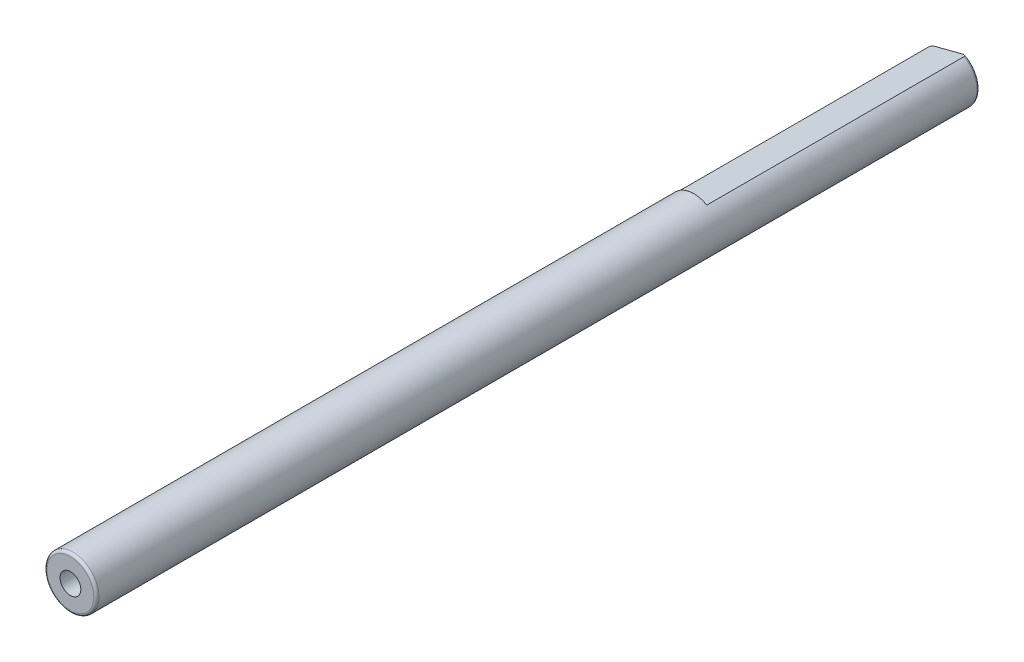
ISO-10303-21;
HEADER;
FILE_DESCRIPTION(('STEP AP214'),'2;1');
FILE_NAME('part.step','',(''),(''),'','','');
FILE_SCHEMA(('AUTOMOTIVE_DESIGN { 1 0 10303 214 1 1 1 1 }'));
ENDSEC;
DATA;
#1=APPLICATION_CONTEXT('core data for automotive mechanical design processes');
#2=APPLICATION_PROTOCOL_DEFINITION('international standard','automotive_design',2000,#1);
#3=PRODUCT_CONTEXT('',#1,'mechanical');
#4=PRODUCT('Part','Part','',(#3));
#5=PRODUCT_RELATED_PRODUCT_CATEGORY('part','',(#4));
#6=PRODUCT_DEFINITION_FORMATION('','',#4);
#7=PRODUCT_DEFINITION_CONTEXT('part definition',#1,'design');
#8=PRODUCT_DEFINITION('design','',#6,#7);
#9=PRODUCT_DEFINITION_SHAPE('','',#8);
#10=(LENGTH_UNIT() NAMED_UNIT(*) SI_UNIT(.MILLI.,.METRE.));
#11=(NAMED_UNIT(*) PLANE_ANGLE_UNIT() SI_UNIT($,.RADIAN.));
#12=(NAMED_UNIT(*) SI_UNIT($,.STERADIAN.) SOLID_ANGLE_UNIT());
#13=UNCERTAINTY_MEASURE_WITH_UNIT(LENGTH_MEASURE(1.E-05),#10,'distance_accuracy_value','');
#14=(GEOMETRIC_REPRESENTATION_CONTEXT(3) GLOBAL_UNCERTAINTY_ASSIGNED_CONTEXT((#13)) GLOBAL_UNIT_ASSIGNED_CONTEXT((#10,
#11,#12)) REPRESENTATION_CONTEXT('',''));
#15=CARTESIAN_POINT('',(0.,0.,0.));
#16=DIRECTION('',(0.,0.,1.));
#17=DIRECTION('',(1.,0.,0.));
#18=AXIS2_PLACEMENT_3D('',#15,#16,#17);
#19=CARTESIAN_POINT('',(0.,0.,-85.));
#20=DIRECTION('',(0.,0.,1.));
#21=DIRECTION('',(-1.,0.,0.));
#22=AXIS2_PLACEMENT_3D('',#19,#20,#21);
#23=CYLINDRICAL_SURFACE('',#22,2.5);
#24=CARTESIAN_POINT('',(0.,0.,-84.75));
#25=DIRECTION('',(0.,0.,1.));
#26=DIRECTION('',(1.,0.,0.));
#27=AXIS2_PLACEMENT_3D('',#24,#25,#26);
#28=CIRCLE('',#27,2.5);
#29=CARTESIAN_POINT('',(1.24656963311538,2.16704041258916,-84.75));
#30=VERTEX_POINT('',#29);
#31=CARTESIAN_POINT('',(-2.14167556849486,1.28966110250416,-84.75));
#32=VERTEX_POINT('',#31);
#33=EDGE_CURVE('E105',#30,#32,#28,.F.);
#34=ORIENTED_EDGE('',*,*,#33,.F.);
#35=DIRECTION('',(0.,0.,-1.));
#36=VECTOR('',#35,1.);
#37=CARTESIAN_POINT('',(1.24656963311538,2.16704041258916,-60.));
#38=LINE('',#37,#36);
#39=CARTESIAN_POINT('',(1.24656963311538,2.16704041258916,-60.));
#40=VERTEX_POINT('',#39);
#41=EDGE_CURVE('E85',#40,#30,#38,.T.);
#42=ORIENTED_EDGE('',*,*,#41,.F.);
#43=CARTESIAN_POINT('',(0.,0.,-60.));
#44=DIRECTION('',(0.,0.,1.));
#45=DIRECTION('',(1.,0.,0.));
#46=AXIS2_PLACEMENT_3D('',#43,#44,#45);
#47=CIRCLE('',#46,2.5);
#48=CARTESIAN_POINT('',(-2.14167556849486,1.28966110250416,-60.));
#49=VERTEX_POINT('',#48);
#50=EDGE_CURVE('E78',#40,#49,#47,.T.);
#51=ORIENTED_EDGE('',*,*,#50,.T.);
#52=DIRECTION('',(0.,0.,-1.));
#53=VECTOR('',#52,1.);
#54=CARTESIAN_POINT('',(-2.14167556849486,1.28966110250416,-60.));
#55=LINE('',#54,#53);
#56=EDGE_CURVE('E80',#49,#32,#55,.T.);
#57=ORIENTED_EDGE('',*,*,#56,.T.);
#58=EDGE_LOOP('',(#34,#42,#51,#57));
#59=FACE_BOUND('',#58,.T.);
#60=CARTESIAN_POINT('',(0.,0.,-0.25));
#61=DIRECTION('',(0.,0.,1.));
#62=DIRECTION('',(1.,0.,0.));
#63=AXIS2_PLACEMENT_3D('',#60,#61,#62);
#64=CIRCLE('',#63,2.5);
#65=CARTESIAN_POINT('',(2.5,0.,-0.25));
#66=VERTEX_POINT('',#65);
#67=EDGE_CURVE('E102',#66,#66,#64,.T.);
#68=ORIENTED_EDGE('',*,*,#67,.F.);
#69=EDGE_LOOP('',(#68));
#70=FACE_BOUND('',#69,.T.);
#71=ADVANCED_FACE('F37',(#59,#70),#23,.T.);
#72=CARTESIAN_POINT('',(0.,0.,-85.));
#73=DIRECTION('',(0.,0.,-1.));
#74=DIRECTION('',(1.,0.,0.));
#75=AXIS2_PLACEMENT_3D('',#72,#73,#74);
#76=PLANE('',#75);
#77=DIRECTION('',(0.968070057602924,0.250679802881428,0.));
#78=VECTOR('',#77,1.);
#79=CARTESIAN_POINT('',(-2.14167556849486,1.28966110250416,-85.));
#80=LINE('',#79,#78);
#81=CARTESIAN_POINT('',(-1.77313748717586,1.38509330067389,-85.));
#82=VERTEX_POINT('',#81);
#83=CARTESIAN_POINT('',(0.87803155179638,2.07160821441943,-85.));
#84=VERTEX_POINT('',#83);
#85=EDGE_CURVE('E88',#82,#84,#80,.T.);
#86=ORIENTED_EDGE('',*,*,#85,.T.);
#87=CARTESIAN_POINT('',(0.,0.,-85.));
#88=DIRECTION('',(0.,0.,1.));
#89=DIRECTION('',(1.,0.,0.));
#90=AXIS2_PLACEMENT_3D('',#87,#88,#89);
#91=CIRCLE('',#90,2.25);
#92=EDGE_CURVE('E100',#82,#84,#91,.T.);
#93=ORIENTED_EDGE('',*,*,#92,.F.);
#94=EDGE_LOOP('',(#86,#93));
#95=FACE_BOUND('',#94,.T.);
#96=CARTESIAN_POINT('',(0.,0.,-85.));
#97=DIRECTION('',(0.,0.,1.));
#98=DIRECTION('',(1.,0.,0.));
#99=AXIS2_PLACEMENT_3D('',#96,#97,#98);
#100=CIRCLE('',#99,1.25);
#101=CARTESIAN_POINT('',(1.25,0.,-85.));
#102=VERTEX_POINT('',#101);
#103=EDGE_CURVE('E97',#102,#102,#100,.F.);
#104=ORIENTED_EDGE('',*,*,#103,.F.);
#105=EDGE_LOOP('',(#104));
#106=FACE_BOUND('',#105,.T.);
#107=ADVANCED_FACE('F134',(#95,#106),#76,.T.);
#108=CARTESIAN_POINT('',(0.,0.,0.));
#109=DIRECTION('',(0.,0.,-1.));
#110=DIRECTION('',(1.,0.,0.));
#111=AXIS2_PLACEMENT_3D('',#108,#109,#110);
#112=PLANE('',#111);
#113=CARTESIAN_POINT('',(0.,0.,0.));
#114=DIRECTION('',(0.,0.,1.));
#115=DIRECTION('',(1.,0.,0.));
#116=AXIS2_PLACEMENT_3D('',#113,#114,#115);
#117=CIRCLE('',#116,2.25);
#118=CARTESIAN_POINT('',(2.25,0.,0.));
#119=VERTEX_POINT('',#118);
#120=EDGE_CURVE('E110',#119,#119,#117,.F.);
#121=ORIENTED_EDGE('',*,*,#120,.F.);
#122=EDGE_LOOP('',(#121));
#123=FACE_BOUND('',#122,.T.);
#124=CARTESIAN_POINT('',(0.,0.,0.));
#125=DIRECTION('',(0.,0.,1.));
#126=DIRECTION('',(1.,0.,0.));
#127=AXIS2_PLACEMENT_3D('',#124,#125,#126);
#128=CIRCLE('',#127,1.);
#129=CARTESIAN_POINT('',(1.,0.,0.));
#130=VERTEX_POINT('',#129);
#131=EDGE_CURVE('E93',#130,#130,#128,.T.);
#132=ORIENTED_EDGE('',*,*,#131,.F.);
#133=EDGE_LOOP('',(#132));
#134=FACE_BOUND('',#133,.T.);
#135=ADVANCED_FACE('F138',(#123,#134),#112,.F.);
#136=CARTESIAN_POINT('',(0.,0.,0.));
#137=DIRECTION('',(0.,0.,-1.));
#138=DIRECTION('',(1.,0.,0.));
#139=AXIS2_PLACEMENT_3D('',#136,#137,#138);
#140=CYLINDRICAL_SURFACE('',#139,1.);
#141=CARTESIAN_POINT('',(0.,0.,-84.75));
#142=DIRECTION('',(0.,0.,1.));
#143=DIRECTION('',(1.,0.,0.));
#144=AXIS2_PLACEMENT_3D('',#141,#142,#143);
#145=CIRCLE('',#144,1.);
#146=CARTESIAN_POINT('',(1.,0.,-84.75));
#147=VERTEX_POINT('',#146);
#148=EDGE_CURVE('E107',#147,#147,#145,.T.);
#149=ORIENTED_EDGE('',*,*,#148,.F.);
#150=EDGE_LOOP('',(#149));
#151=FACE_BOUND('',#150,.T.);
#152=ORIENTED_EDGE('',*,*,#131,.T.);
#153=EDGE_LOOP('',(#152));
#154=FACE_BOUND('',#153,.T.);
#155=ADVANCED_FACE('F123',(#151,#154),#140,.F.);
#156=CARTESIAN_POINT('',(0.,0.,-84.75));
#157=DIRECTION('',(0.,0.,-1.));
#158=DIRECTION('',(1.,0.,0.));
#159=AXIS2_PLACEMENT_3D('',#156,#157,#158);
#160=TOROIDAL_SURFACE('',#159,2.25,0.25);
#161=CARTESIAN_POINT('',(0.425053761878825,1.95431052279639,-84.7498));
#162=CARTESIAN_POINT('',(0.425022132917158,1.95430233254011,-84.7568191708284));
#163=CARTESIAN_POINT('',(0.425663766025406,1.95446848214863,-84.7638122340751));
#164=CARTESIAN_POINT('',(0.428110624978154,1.95510209137468,-84.7774897210039));
#165=CARTESIAN_POINT('',(0.429900948447859,1.95556569205208,-84.7841769388553));
#166=CARTESIAN_POINT('',(0.435087518952933,1.9569087440984,-84.7989295884776));
#167=CARTESIAN_POINT('',(0.438787022899222,1.95786672323713,-84.8068790375475));
#168=CARTESIAN_POINT('',(0.447370133828811,1.9600893026249,-84.8220962902687));
#169=CARTESIAN_POINT('',(0.452260267760066,1.96135559301403,-84.8293600193247));
#170=CARTESIAN_POINT('',(0.466411005574552,1.96501989823461,-84.8478095285237));
#171=CARTESIAN_POINT('',(0.476412152265188,1.96760967514312,-84.858382460304));
#172=CARTESIAN_POINT('',(0.497755111910061,1.97313639180444,-84.8779326565168));
#173=CARTESIAN_POINT('',(0.509099667963738,1.97607404187736,-84.8869065590171));
#174=CARTESIAN_POINT('',(0.543753589675399,1.98504760551103,-84.9114391675026));
#175=CARTESIAN_POINT('',(0.56824261872814,1.9913889905456,-84.925210853844));
#176=CARTESIAN_POINT('',(0.618834247949331,2.00448959162402,-84.9490780861197));
#177=CARTESIAN_POINT('',(0.644941506733713,2.01125001400714,-84.9591623814683));
#178=CARTESIAN_POINT('',(0.709640716167357,2.02800374473151,-84.9797134317033));
#179=CARTESIAN_POINT('',(0.748752500252955,2.03813166290016,-84.9884623523169));
#180=CARTESIAN_POINT('',(0.827804175518326,2.05860193591122,-84.999201566197));
#181=CARTESIAN_POINT('',(0.867742736155735,2.06894394621236,-85.0012019804268));
#182=CARTESIAN_POINT('',(0.933553221984782,2.08598543973403,-84.9980587220651));
#183=CARTESIAN_POINT('',(0.959526473161087,2.09271116111538,-84.9951407949997));
#184=CARTESIAN_POINT('',(1.0107922624953,2.10598633460508,-84.9854326805404));
#185=CARTESIAN_POINT('',(1.03608594450483,2.11253608291151,-84.9786494906682));
#186=CARTESIAN_POINT('',(1.07777015711749,2.12333012629602,-84.9632422670608));
#187=CARTESIAN_POINT('',(1.09456021063539,2.12767787703284,-84.9557762430456));
#188=CARTESIAN_POINT('',(1.12687777728902,2.13604644620272,-84.9383188566183));
#189=CARTESIAN_POINT('',(1.142406952852,2.14006769511799,-84.9283308931783));
#190=CARTESIAN_POINT('',(1.16754582153321,2.14657735482306,-84.9086403937822));
#191=CARTESIAN_POINT('',(1.17762557139123,2.14918748586436,-84.8995808367024));
#192=CARTESIAN_POINT('',(1.19628625750905,2.15401963316704,-84.8799320402253));
#193=CARTESIAN_POINT('',(1.20486906917711,2.15624213506163,-84.8693447456724));
#194=CARTESIAN_POINT('',(1.21854421977081,2.15978328792374,-84.848925051505));
#195=CARTESIAN_POINT('',(1.22399078376004,2.16119366476215,-84.8393467472286));
#196=CARTESIAN_POINT('',(1.23327484376571,2.16359775350953,-84.8193989029678));
#197=CARTESIAN_POINT('',(1.23711559806018,2.16459230914307,-84.8090310161521));
#198=CARTESIAN_POINT('',(1.2421786434389,2.16590337460527,-84.7905112509126));
#199=CARTESIAN_POINT('',(1.24382143998123,2.16632877348025,-84.7824807397061));
#200=CARTESIAN_POINT('',(1.24602692076251,2.16689987831215,-84.7662365219919));
#201=CARTESIAN_POINT('',(1.24658597471944,2.16704464421481,-84.7580222926771));
#202=CARTESIAN_POINT('',(1.24656952247878,2.16704038394003,-84.7498));
#203=B_SPLINE_CURVE_WITH_KNOTS('',3,(#161,#162,#163,#164,#165,#166,#167,#168,#169,#170,#171,
#172,#173,#174,#175,#176,#177,#178,#179,#180,#181,#182,#183,#184,#185,#186,#187,#188,#189,#190,
#191,#192,#193,#194,#195,#196,#197,#198,#199,#200,#201,#202),.UNSPECIFIED.,.F.,.F.,(4,2,2,2,2,2,
2,2,2,2,2,2,2,2,2,2,2,2,2,2,4),(0.,0.0209811316456926,0.0416954249068607,0.0680081601276865,
0.0944685227141209,0.138565568306266,0.182754260482958,0.268683116398199,0.354872004046447,
0.478305717839832,0.601554231424503,0.682300505968247,0.762901062907967,0.819386018763245,
0.875795248991933,0.917063473857081,0.958279619371743,0.991474295494567,1.02460128698995,
1.04915022391161,1.07378125284237),.UNSPECIFIED.);
#204=EDGE_CURVE('E11',#84,#30,#203,.T.);
#205=ORIENTED_EDGE('',*,*,#204,.T.);
#206=ORIENTED_EDGE('',*,*,#33,.T.);
#207=CARTESIAN_POINT('',(-2.14167545785826,1.28966113115328,-84.7498));
#208=CARTESIAN_POINT('',(-2.14171224821897,1.28965160436305,-84.7608512320649));
#209=CARTESIAN_POINT('',(-2.1406882898033,1.28991675634434,-84.7718778596826));
#210=CARTESIAN_POINT('',(-2.13672949595835,1.29094187808311,-84.7934679845931));
#211=CARTESIAN_POINT('',(-2.13381060670334,1.29169771861069,-84.8040345684732));
#212=CARTESIAN_POINT('',(-2.12627592797966,1.29364880857819,-84.8244598014821));
#213=CARTESIAN_POINT('',(-2.12166433479978,1.29484297139753,-84.8343201298147));
#214=CARTESIAN_POINT('',(-2.11102048240825,1.29759917566028,-84.8531993834641));
#215=CARTESIAN_POINT('',(-2.10498523707209,1.29916199035466,-84.8622164838176));
#216=CARTESIAN_POINT('',(-2.0891899522798,1.30325214772198,-84.8826445990604));
#217=CARTESIAN_POINT('',(-2.07889587767031,1.30591777772849,-84.8936145679418));
#218=CARTESIAN_POINT('',(-2.05674323972074,1.31165415896546,-84.913704852529));
#219=CARTESIAN_POINT('',(-2.04488185384281,1.31472564108644,-84.9228217540616));
#220=CARTESIAN_POINT('',(-2.01463923624281,1.32255690635391,-84.9429234816592));
#221=CARTESIAN_POINT('',(-1.99567906199685,1.32746660550765,-84.9529755173965));
#222=CARTESIAN_POINT('',(-1.95648977092357,1.33761459395555,-84.9698986634325));
#223=CARTESIAN_POINT('',(-1.93625851453852,1.3428534372839,-84.976764237885));
#224=CARTESIAN_POINT('',(-1.88499761051522,1.35612734573212,-84.9904238258284));
#225=CARTESIAN_POINT('',(-1.85354701366388,1.36427141480778,-84.9955247727872));
#226=CARTESIAN_POINT('',(-1.79026637803352,1.38065780868645,-85.0006140303183));
#227=CARTESIAN_POINT('',(-1.75843570940059,1.38890029658887,-85.0005921604285));
#228=CARTESIAN_POINT('',(-1.69375656590205,1.40564883127953,-84.9959772907134));
#229=CARTESIAN_POINT('',(-1.66092152783862,1.41415139863476,-84.9911922444688));
#230=CARTESIAN_POINT('',(-1.59622233372271,1.43090512539264,-84.9770835016307));
#231=CARTESIAN_POINT('',(-1.56435653492472,1.43915671018095,-84.9677679983586));
#232=CARTESIAN_POINT('',(-1.51483782482241,1.45197948100203,-84.9490673304093));
#233=CARTESIAN_POINT('',(-1.49663274338225,1.45669365038576,-84.94122337951));
#234=CARTESIAN_POINT('',(-1.46108703977681,1.46589813915505,-84.9235948533831));
#235=CARTESIAN_POINT('',(-1.44374678402905,1.47038836365753,-84.9138094641841));
#236=CARTESIAN_POINT('',(-1.41442343807823,1.47798158537227,-84.8944774764691));
#237=CARTESIAN_POINT('',(-1.40214106281724,1.48116208185096,-84.8854183256589));
#238=CARTESIAN_POINT('',(-1.37891012176449,1.48717768751722,-84.8656223205263));
#239=CARTESIAN_POINT('',(-1.36795745382673,1.49001385894728,-84.8548908719589));
#240=CARTESIAN_POINT('',(-1.352963863115,1.49389641923781,-84.8368992875672));
#241=CARTESIAN_POINT('',(-1.3480949394441,1.4951572172725,-84.8303803125725));
#242=CARTESIAN_POINT('',(-1.33924979716044,1.49744764915469,-84.8167162472778));
#243=CARTESIAN_POINT('',(-1.33527285515301,1.49847747032379,-84.8095716709255));
#244=CARTESIAN_POINT('',(-1.32905451564143,1.50008769688825,-84.7958487143419));
#245=CARTESIAN_POINT('',(-1.3266392320052,1.50071312974931,-84.7893556231265));
#246=CARTESIAN_POINT('',(-1.32288936105379,1.50168415132316,-84.7760518240812));
#247=CARTESIAN_POINT('',(-1.32155183705663,1.50203050048387,-84.7692420331865));
#248=CARTESIAN_POINT('',(-1.32037065527532,1.50233636514085,-84.7581947002053));
#249=CARTESIAN_POINT('',(-1.32014654500396,1.50239439804685,-84.7539976675758));
#250=CARTESIAN_POINT('',(-1.32015969725831,1.50239099229692,-84.7498));
#251=B_SPLINE_CURVE_WITH_KNOTS('',3,(#207,#208,#209,#210,#211,#212,#213,#214,#215,#216,#217,
#218,#219,#220,#221,#222,#223,#224,#225,#226,#227,#228,#229,#230,#231,#232,#233,#234,#235,#236,
#237,#238,#239,#240,#241,#242,#243,#244,#245,#246,#247,#248,#249,#250),.UNSPECIFIED.,.F.,.F.,(4,
2,2,2,2,2,2,2,2,2,2,2,2,2,2,2,2,2,2,2,2,4),(0.,0.0330610723724453,0.0658474745302223,
0.0985531407062349,0.13132802708968,0.176907495817816,0.222570195781612,0.28824746892834,
0.354038420136997,0.452159469521612,0.550475514375829,0.652922931865517,0.755185758550748,
0.816233715408757,0.877307321655502,0.923984365944858,0.970513540841106,0.995159236920087,
1.01978487254745,1.04057268476436,1.06130366092345,1.07389006473428),.UNSPECIFIED.);
#252=EDGE_CURVE('E50',#32,#82,#251,.T.);
#253=ORIENTED_EDGE('',*,*,#252,.T.);
#254=ORIENTED_EDGE('',*,*,#92,.T.);
#255=EDGE_LOOP('',(#205,#206,#253,#254));
#256=FACE_BOUND('',#255,.T.);
#257=ADVANCED_FACE('F118',(#256),#160,.T.);
#258=CARTESIAN_POINT('',(0.,0.,-84.75));
#259=DIRECTION('',(0.,0.,-1.));
#260=DIRECTION('',(1.,0.,0.));
#261=AXIS2_PLACEMENT_3D('',#258,#259,#260);
#262=TOROIDAL_SURFACE('',#261,1.25,0.25);
#263=ORIENTED_EDGE('',*,*,#103,.T.);
#264=EDGE_LOOP('',(#263));
#265=FACE_BOUND('',#264,.T.);
#266=ORIENTED_EDGE('',*,*,#148,.T.);
#267=EDGE_LOOP('',(#266));
#268=FACE_BOUND('',#267,.T.);
#269=ADVANCED_FACE('F122',(#265,#268),#262,.T.);
#270=CARTESIAN_POINT('',(0.,0.,-0.25));
#271=DIRECTION('',(0.,0.,-1.));
#272=DIRECTION('',(1.,0.,0.));
#273=AXIS2_PLACEMENT_3D('',#270,#271,#272);
#274=TOROIDAL_SURFACE('',#273,2.25,0.25);
#275=ORIENTED_EDGE('',*,*,#120,.T.);
#276=EDGE_LOOP('',(#275));
#277=FACE_BOUND('',#276,.T.);
#278=ORIENTED_EDGE('',*,*,#67,.T.);
#279=EDGE_LOOP('',(#278));
#280=FACE_BOUND('',#279,.T.);
#281=ADVANCED_FACE('F39',(#277,#280),#274,.T.);
#282=CARTESIAN_POINT('',(-2.14167556849486,1.28966110250416,-60.));
#283=DIRECTION('',(0.250679802881428,-0.968070057602924,0.));
#284=DIRECTION('',(0.968070057602924,0.250679802881428,0.));
#285=AXIS2_PLACEMENT_3D('',#282,#283,#284);
#286=PLANE('',#285);
#287=ORIENTED_EDGE('',*,*,#204,.F.);
#288=ORIENTED_EDGE('',*,*,#85,.F.);
#289=ORIENTED_EDGE('',*,*,#252,.F.);
#290=ORIENTED_EDGE('',*,*,#56,.F.);
#291=DIRECTION('',(0.968070057602924,0.250679802881428,0.));
#292=VECTOR('',#291,1.);
#293=CARTESIAN_POINT('',(-2.14167556849486,1.28966110250416,-60.));
#294=LINE('',#293,#292);
#295=EDGE_CURVE('E75',#49,#40,#294,.T.);
#296=ORIENTED_EDGE('',*,*,#295,.T.);
#297=ORIENTED_EDGE('',*,*,#41,.T.);
#298=EDGE_LOOP('',(#287,#288,#289,#290,#296,#297));
#299=FACE_BOUND('',#298,.T.);
#300=ADVANCED_FACE('F82',(#299),#286,.F.);
#301=CARTESIAN_POINT('',(0.,0.,-60.));
#302=DIRECTION('',(0.,0.,-1.));
#303=DIRECTION('',(1.,0.,0.));
#304=AXIS2_PLACEMENT_3D('',#301,#302,#303);
#305=PLANE('',#304);
#306=ORIENTED_EDGE('',*,*,#50,.F.);
#307=ORIENTED_EDGE('',*,*,#295,.F.);
#308=EDGE_LOOP('',(#306,#307));
#309=FACE_BOUND('',#308,.T.);
#310=ADVANCED_FACE('F76',(#309),#305,.T.);
#311=CLOSED_SHELL('',(#71,#107,#135,#155,#257,#269,#281,#300,#310));
#312=MANIFOLD_SOLID_BREP('B2',#311);
#313=ADVANCED_BREP_SHAPE_REPRESENTATION('',(#18,#312),#14);
#314=SHAPE_DEFINITION_REPRESENTATION(#9,#313);
ENDSEC;
END-ISO-10303-21;
